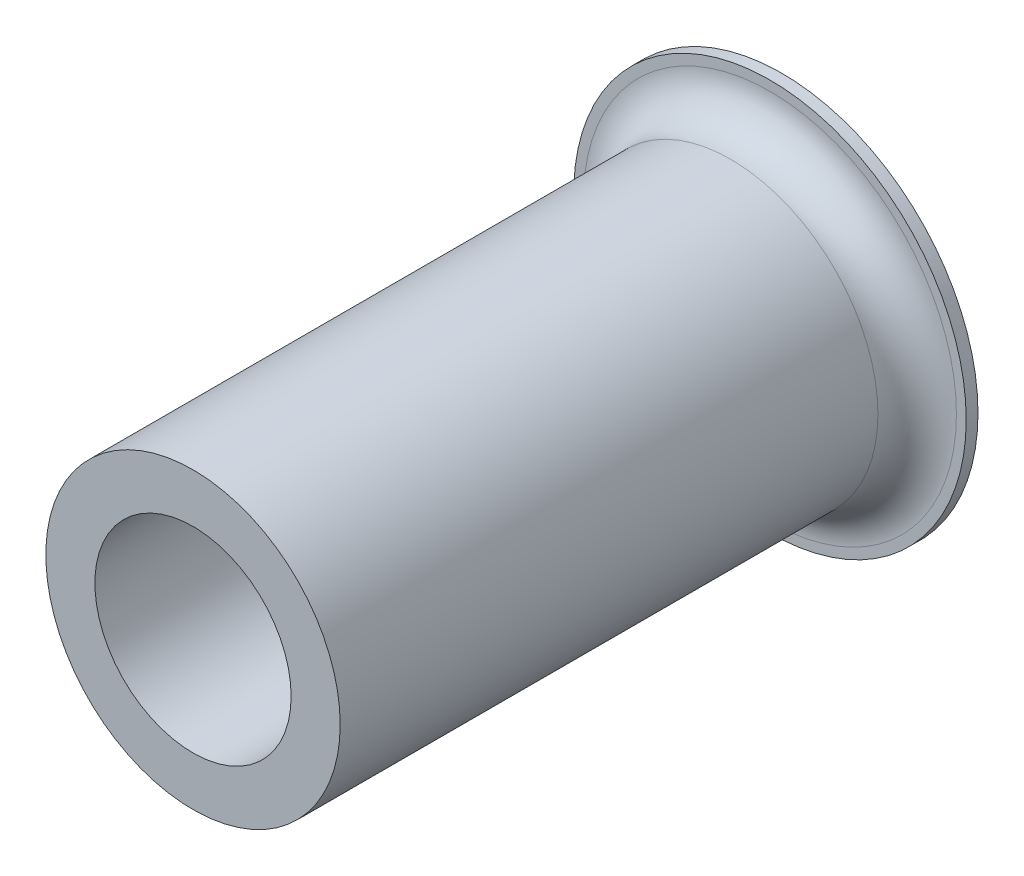
ISO-10303-21;
HEADER;
FILE_DESCRIPTION(('STEP AP214'),'2;1');
FILE_NAME('part.step','',(''),(''),'','','');
FILE_SCHEMA(('AUTOMOTIVE_DESIGN { 1 0 10303 214 1 1 1 1 }'));
ENDSEC;
DATA;
#1=APPLICATION_CONTEXT('core data for automotive mechanical design processes');
#2=APPLICATION_PROTOCOL_DEFINITION('international standard','automotive_design',2000,#1);
#3=PRODUCT_CONTEXT('',#1,'mechanical');
#4=PRODUCT('Part','Part','',(#3));
#5=PRODUCT_RELATED_PRODUCT_CATEGORY('part','',(#4));
#6=PRODUCT_DEFINITION_FORMATION('','',#4);
#7=PRODUCT_DEFINITION_CONTEXT('part definition',#1,'design');
#8=PRODUCT_DEFINITION('design','',#6,#7);
#9=PRODUCT_DEFINITION_SHAPE('','',#8);
#10=(LENGTH_UNIT() NAMED_UNIT(*) SI_UNIT(.MILLI.,.METRE.));
#11=(NAMED_UNIT(*) PLANE_ANGLE_UNIT() SI_UNIT($,.RADIAN.));
#12=(NAMED_UNIT(*) SI_UNIT($,.STERADIAN.) SOLID_ANGLE_UNIT());
#13=UNCERTAINTY_MEASURE_WITH_UNIT(LENGTH_MEASURE(1.E-05),#10,'distance_accuracy_value','');
#14=(GEOMETRIC_REPRESENTATION_CONTEXT(3) GLOBAL_UNCERTAINTY_ASSIGNED_CONTEXT((#13)) GLOBAL_UNIT_ASSIGNED_CONTEXT((#10,
#11,#12)) REPRESENTATION_CONTEXT('',''));
#15=CARTESIAN_POINT('',(0.,0.,0.));
#16=DIRECTION('',(0.,0.,1.));
#17=DIRECTION('',(1.,0.,0.));
#18=AXIS2_PLACEMENT_3D('',#15,#16,#17);
#19=CARTESIAN_POINT('',(0.,0.,150.));
#20=DIRECTION('',(0.,0.,-1.));
#21=DIRECTION('',(-1.,0.,0.));
#22=AXIS2_PLACEMENT_3D('',#19,#20,#21);
#23=CYLINDRICAL_SURFACE('',#22,37.5);
#24=CARTESIAN_POINT('',(0.,0.,13.));
#25=DIRECTION('',(0.,0.,1.));
#26=DIRECTION('',(1.,0.,0.));
#27=AXIS2_PLACEMENT_3D('',#24,#25,#26);
#28=CIRCLE('',#27,37.5);
#29=CARTESIAN_POINT('',(37.5,0.,13.));
#30=VERTEX_POINT('',#29);
#31=EDGE_CURVE('E40',#30,#30,#28,.T.);
#32=ORIENTED_EDGE('',*,*,#31,.T.);
#33=EDGE_LOOP('',(#32));
#34=FACE_BOUND('',#33,.T.);
#35=CARTESIAN_POINT('',(0.,0.,150.));
#36=DIRECTION('',(0.,0.,1.));
#37=DIRECTION('',(1.,0.,0.));
#38=AXIS2_PLACEMENT_3D('',#35,#36,#37);
#39=CIRCLE('',#38,37.5);
#40=CARTESIAN_POINT('',(37.5,0.,150.));
#41=VERTEX_POINT('',#40);
#42=EDGE_CURVE('E44',#41,#41,#39,.T.);
#43=ORIENTED_EDGE('',*,*,#42,.F.);
#44=EDGE_LOOP('',(#43));
#45=FACE_BOUND('',#44,.T.);
#46=ADVANCED_FACE('F33',(#34,#45),#23,.T.);
#47=CARTESIAN_POINT('',(0.,0.,150.));
#48=DIRECTION('',(0.,0.,1.));
#49=DIRECTION('',(1.,0.,0.));
#50=AXIS2_PLACEMENT_3D('',#47,#48,#49);
#51=PLANE('',#50);
#52=CARTESIAN_POINT('',(0.,0.,150.));
#53=DIRECTION('',(0.,0.,1.));
#54=DIRECTION('',(1.,0.,0.));
#55=AXIS2_PLACEMENT_3D('',#52,#53,#54);
#56=CIRCLE('',#55,24.9999999999986);
#57=CARTESIAN_POINT('',(24.9999999999986,0.,150.));
#58=VERTEX_POINT('',#57);
#59=EDGE_CURVE('E53',#58,#58,#56,.T.);
#60=ORIENTED_EDGE('',*,*,#59,.F.);
#61=EDGE_LOOP('',(#60));
#62=FACE_BOUND('',#61,.T.);
#63=ORIENTED_EDGE('',*,*,#42,.T.);
#64=EDGE_LOOP('',(#63));
#65=FACE_BOUND('',#64,.T.);
#66=ADVANCED_FACE('F84',(#62,#65),#51,.T.);
#67=CARTESIAN_POINT('',(0.,0.,-70.7106781186507));
#68=DIRECTION('',(0.,0.,1.));
#69=DIRECTION('',(1.,0.,0.));
#70=AXIS2_PLACEMENT_3D('',#67,#68,#69);
#71=CYLINDRICAL_SURFACE('',#70,24.9999999999986);
#72=CARTESIAN_POINT('',(0.,0.,5.));
#73=DIRECTION('',(0.,0.,1.));
#74=DIRECTION('',(1.,0.,0.));
#75=AXIS2_PLACEMENT_3D('',#72,#73,#74);
#76=CIRCLE('',#75,24.9999999999986);
#77=CARTESIAN_POINT('',(24.9999999999986,0.,5.));
#78=VERTEX_POINT('',#77);
#79=EDGE_CURVE('E48',#78,#78,#76,.F.);
#80=ORIENTED_EDGE('',*,*,#79,.T.);
#81=EDGE_LOOP('',(#80));
#82=FACE_BOUND('',#81,.T.);
#83=ORIENTED_EDGE('',*,*,#59,.T.);
#84=EDGE_LOOP('',(#83));
#85=FACE_BOUND('',#84,.T.);
#86=ADVANCED_FACE('F88',(#82,#85),#71,.F.);
#87=CARTESIAN_POINT('',(0.,0.,5.));
#88=DIRECTION('',(0.,0.,1.));
#89=DIRECTION('',(1.,0.,0.));
#90=AXIS2_PLACEMENT_3D('',#87,#88,#89);
#91=PLANE('',#90);
#92=ORIENTED_EDGE('',*,*,#79,.F.);
#93=EDGE_LOOP('',(#92));
#94=FACE_BOUND('',#93,.T.);
#95=ADVANCED_FACE('F68',(#94),#91,.T.);
#96=CARTESIAN_POINT('',(0.,0.,3.));
#97=DIRECTION('',(0.,0.,-1.));
#98=DIRECTION('',(-1.,0.,0.));
#99=AXIS2_PLACEMENT_3D('',#96,#97,#98);
#100=CYLINDRICAL_SURFACE('',#99,50.);
#101=CARTESIAN_POINT('',(0.,0.,3.));
#102=DIRECTION('',(0.,0.,1.));
#103=DIRECTION('',(1.,0.,0.));
#104=AXIS2_PLACEMENT_3D('',#101,#102,#103);
#105=CIRCLE('',#104,50.);
#106=CARTESIAN_POINT('',(50.,0.,3.));
#107=VERTEX_POINT('',#106);
#108=EDGE_CURVE('E56',#107,#107,#105,.T.);
#109=ORIENTED_EDGE('',*,*,#108,.F.);
#110=EDGE_LOOP('',(#109));
#111=FACE_BOUND('',#110,.T.);
#112=CARTESIAN_POINT('',(0.,0.,0.));
#113=DIRECTION('',(0.,0.,1.));
#114=DIRECTION('',(1.,0.,0.));
#115=AXIS2_PLACEMENT_3D('',#112,#113,#114);
#116=CIRCLE('',#115,50.);
#117=CARTESIAN_POINT('',(50.,0.,0.));
#118=VERTEX_POINT('',#117);
#119=EDGE_CURVE('E57',#118,#118,#116,.T.);
#120=ORIENTED_EDGE('',*,*,#119,.T.);
#121=EDGE_LOOP('',(#120));
#122=FACE_BOUND('',#121,.T.);
#123=ADVANCED_FACE('F65',(#111,#122),#100,.T.);
#124=CARTESIAN_POINT('',(0.,0.,3.));
#125=DIRECTION('',(0.,0.,1.));
#126=DIRECTION('',(1.,0.,0.));
#127=AXIS2_PLACEMENT_3D('',#124,#125,#126);
#128=PLANE('',#127);
#129=CARTESIAN_POINT('',(0.,0.,3.));
#130=DIRECTION('',(0.,0.,1.));
#131=DIRECTION('',(1.,0.,0.));
#132=AXIS2_PLACEMENT_3D('',#129,#130,#131);
#133=CIRCLE('',#132,47.5);
#134=CARTESIAN_POINT('',(47.5,0.,3.));
#135=VERTEX_POINT('',#134);
#136=EDGE_CURVE('E11',#135,#135,#133,.F.);
#137=ORIENTED_EDGE('',*,*,#136,.T.);
#138=EDGE_LOOP('',(#137));
#139=FACE_BOUND('',#138,.T.);
#140=ORIENTED_EDGE('',*,*,#108,.T.);
#141=EDGE_LOOP('',(#140));
#142=FACE_BOUND('',#141,.T.);
#143=ADVANCED_FACE('F63',(#139,#142),#128,.T.);
#144=CARTESIAN_POINT('',(0.,0.,0.));
#145=DIRECTION('',(0.,0.,1.));
#146=DIRECTION('',(1.,0.,0.));
#147=AXIS2_PLACEMENT_3D('',#144,#145,#146);
#148=PLANE('',#147);
#149=ORIENTED_EDGE('',*,*,#119,.F.);
#150=EDGE_LOOP('',(#149));
#151=FACE_BOUND('',#150,.T.);
#152=ADVANCED_FACE('F72',(#151),#148,.F.);
#153=CARTESIAN_POINT('',(0.,0.,13.));
#154=DIRECTION('',(0.,0.,1.));
#155=DIRECTION('',(1.,0.,0.));
#156=AXIS2_PLACEMENT_3D('',#153,#154,#155);
#157=TOROIDAL_SURFACE('',#156,47.5,10.);
#158=ORIENTED_EDGE('',*,*,#136,.F.);
#159=EDGE_LOOP('',(#158));
#160=FACE_BOUND('',#159,.T.);
#161=ORIENTED_EDGE('',*,*,#31,.F.);
#162=EDGE_LOOP('',(#161));
#163=FACE_BOUND('',#162,.T.);
#164=ADVANCED_FACE('F35',(#160,#163),#157,.F.);
#165=CLOSED_SHELL('',(#46,#66,#86,#95,#123,#143,#152,#164));
#166=MANIFOLD_SOLID_BREP('B2',#165);
#167=ADVANCED_BREP_SHAPE_REPRESENTATION('',(#18,#166),#14);
#168=SHAPE_DEFINITION_REPRESENTATION(#9,#167);
ENDSEC;
END-ISO-10303-21;
